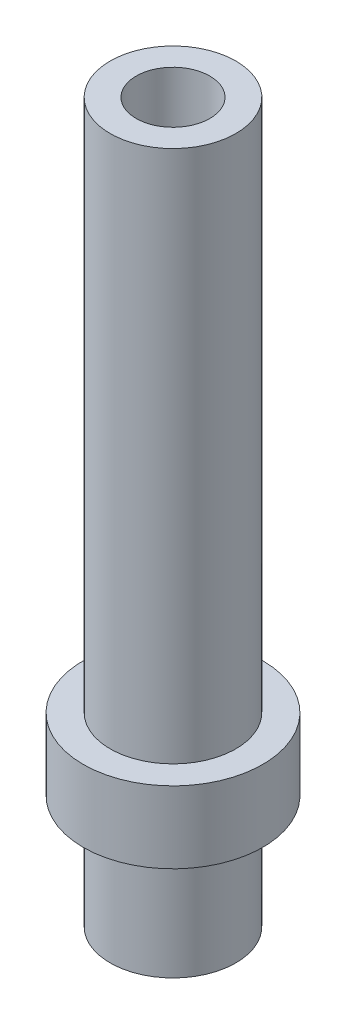
ISO-10303-21;
HEADER;
FILE_DESCRIPTION(('STEP AP214'),'2;1');
FILE_NAME('part.step','',(''),(''),'','','');
FILE_SCHEMA(('AUTOMOTIVE_DESIGN { 1 0 10303 214 1 1 1 1 }'));
ENDSEC;
DATA;
#1=APPLICATION_CONTEXT('core data for automotive mechanical design processes');
#2=APPLICATION_PROTOCOL_DEFINITION('international standard','automotive_design',2000,#1);
#3=PRODUCT_CONTEXT('',#1,'mechanical');
#4=PRODUCT('Part','Part','',(#3));
#5=PRODUCT_RELATED_PRODUCT_CATEGORY('part','',(#4));
#6=PRODUCT_DEFINITION_FORMATION('','',#4);
#7=PRODUCT_DEFINITION_CONTEXT('part definition',#1,'design');
#8=PRODUCT_DEFINITION('design','',#6,#7);
#9=PRODUCT_DEFINITION_SHAPE('','',#8);
#10=(LENGTH_UNIT() NAMED_UNIT(*) SI_UNIT(.MILLI.,.METRE.));
#11=(NAMED_UNIT(*) PLANE_ANGLE_UNIT() SI_UNIT($,.RADIAN.));
#12=(NAMED_UNIT(*) SI_UNIT($,.STERADIAN.) SOLID_ANGLE_UNIT());
#13=UNCERTAINTY_MEASURE_WITH_UNIT(LENGTH_MEASURE(1.E-05),#10,'distance_accuracy_value','');
#14=(GEOMETRIC_REPRESENTATION_CONTEXT(3) GLOBAL_UNCERTAINTY_ASSIGNED_CONTEXT((#13)) GLOBAL_UNIT_ASSIGNED_CONTEXT((#10,
#11,#12)) REPRESENTATION_CONTEXT('',''));
#15=CARTESIAN_POINT('',(0.,0.,0.));
#16=DIRECTION('',(0.,0.,1.));
#17=DIRECTION('',(1.,0.,0.));
#18=AXIS2_PLACEMENT_3D('',#15,#16,#17);
#19=CARTESIAN_POINT('',(0.,0.,-17.5));
#20=DIRECTION('',(0.,-1.,0.));
#21=DIRECTION('',(0.,0.,-1.));
#22=AXIS2_PLACEMENT_3D('',#19,#20,#21);
#23=PLANE('',#22);
#24=CARTESIAN_POINT('',(0.,0.,0.));
#25=DIRECTION('',(0.,-1.,0.));
#26=DIRECTION('',(0.,0.,-1.));
#27=AXIS2_PLACEMENT_3D('',#24,#25,#26);
#28=CIRCLE('',#27,17.5);
#29=CARTESIAN_POINT('',(0.,0.,-17.5));
#30=VERTEX_POINT('',#29);
#31=EDGE_CURVE('E59',#30,#30,#28,.T.);
#32=ORIENTED_EDGE('',*,*,#31,.T.);
#33=EDGE_LOOP('',(#32));
#34=FACE_BOUND('',#33,.T.);
#35=CARTESIAN_POINT('',(0.,0.,0.));
#36=DIRECTION('',(0.,-1.,0.));
#37=DIRECTION('',(0.,0.,-1.));
#38=AXIS2_PLACEMENT_3D('',#35,#36,#37);
#39=CIRCLE('',#38,10.25);
#40=CARTESIAN_POINT('',(0.,0.,-10.25));
#41=VERTEX_POINT('',#40);
#42=EDGE_CURVE('E10',#41,#41,#39,.T.);
#43=ORIENTED_EDGE('',*,*,#42,.F.);
#44=EDGE_LOOP('',(#43));
#45=FACE_BOUND('',#44,.T.);
#46=ADVANCED_FACE('F31',(#34,#45),#23,.T.);
#47=CARTESIAN_POINT('',(0.,0.,0.));
#48=DIRECTION('',(0.,-1.,0.));
#49=DIRECTION('',(0.,0.,-1.));
#50=AXIS2_PLACEMENT_3D('',#47,#48,#49);
#51=CYLINDRICAL_SURFACE('',#50,10.25);
#52=ORIENTED_EDGE('',*,*,#42,.T.);
#53=EDGE_LOOP('',(#52));
#54=FACE_BOUND('',#53,.T.);
#55=CARTESIAN_POINT('',(0.,200.,0.));
#56=DIRECTION('',(0.,-1.,0.));
#57=DIRECTION('',(0.,0.,-1.));
#58=AXIS2_PLACEMENT_3D('',#55,#56,#57);
#59=CIRCLE('',#58,10.25);
#60=CARTESIAN_POINT('',(0.,200.,-10.25));
#61=VERTEX_POINT('',#60);
#62=EDGE_CURVE('E37',#61,#61,#59,.T.);
#63=ORIENTED_EDGE('',*,*,#62,.F.);
#64=EDGE_LOOP('',(#63));
#65=FACE_BOUND('',#64,.T.);
#66=ADVANCED_FACE('F77',(#54,#65),#51,.F.);
#67=CARTESIAN_POINT('',(0.,200.,-10.25));
#68=DIRECTION('',(0.,1.,0.));
#69=DIRECTION('',(0.,0.,1.));
#70=AXIS2_PLACEMENT_3D('',#67,#68,#69);
#71=PLANE('',#70);
#72=ORIENTED_EDGE('',*,*,#62,.T.);
#73=EDGE_LOOP('',(#72));
#74=FACE_BOUND('',#73,.T.);
#75=CARTESIAN_POINT('',(0.,200.,0.));
#76=DIRECTION('',(0.,-1.,0.));
#77=DIRECTION('',(0.,0.,-1.));
#78=AXIS2_PLACEMENT_3D('',#75,#76,#77);
#79=CIRCLE('',#78,17.5);
#80=CARTESIAN_POINT('',(0.,200.,-17.5));
#81=VERTEX_POINT('',#80);
#82=EDGE_CURVE('E41',#81,#81,#79,.T.);
#83=ORIENTED_EDGE('',*,*,#82,.F.);
#84=EDGE_LOOP('',(#83));
#85=FACE_BOUND('',#84,.T.);
#86=ADVANCED_FACE('F81',(#74,#85),#71,.T.);
#87=CARTESIAN_POINT('',(0.,0.,0.));
#88=DIRECTION('',(0.,-1.,0.));
#89=DIRECTION('',(0.,0.,-1.));
#90=AXIS2_PLACEMENT_3D('',#87,#88,#89);
#91=CYLINDRICAL_SURFACE('',#90,17.5);
#92=ORIENTED_EDGE('',*,*,#82,.T.);
#93=EDGE_LOOP('',(#92));
#94=FACE_BOUND('',#93,.T.);
#95=CARTESIAN_POINT('',(0.,51.6233235976995,0.));
#96=DIRECTION('',(0.,-1.,0.));
#97=DIRECTION('',(0.,0.,-1.));
#98=AXIS2_PLACEMENT_3D('',#95,#96,#97);
#99=CIRCLE('',#98,17.5);
#100=CARTESIAN_POINT('',(0.,51.6233235976995,-17.5));
#101=VERTEX_POINT('',#100);
#102=EDGE_CURVE('E45',#101,#101,#99,.T.);
#103=ORIENTED_EDGE('',*,*,#102,.F.);
#104=EDGE_LOOP('',(#103));
#105=FACE_BOUND('',#104,.T.);
#106=ADVANCED_FACE('F85',(#94,#105),#91,.T.);
#107=CARTESIAN_POINT('',(0.,51.6233235976995,-17.5));
#108=DIRECTION('',(0.,1.,0.));
#109=DIRECTION('',(0.,0.,1.));
#110=AXIS2_PLACEMENT_3D('',#107,#108,#109);
#111=PLANE('',#110);
#112=ORIENTED_EDGE('',*,*,#102,.T.);
#113=EDGE_LOOP('',(#112));
#114=FACE_BOUND('',#113,.T.);
#115=CARTESIAN_POINT('',(0.,51.6233235976995,0.));
#116=DIRECTION('',(0.,-1.,0.));
#117=DIRECTION('',(0.,0.,-1.));
#118=AXIS2_PLACEMENT_3D('',#115,#116,#117);
#119=CIRCLE('',#118,25.);
#120=CARTESIAN_POINT('',(0.,51.6233235976995,-25.));
#121=VERTEX_POINT('',#120);
#122=EDGE_CURVE('E50',#121,#121,#119,.T.);
#123=ORIENTED_EDGE('',*,*,#122,.F.);
#124=EDGE_LOOP('',(#123));
#125=FACE_BOUND('',#124,.T.);
#126=ADVANCED_FACE('F91',(#114,#125),#111,.T.);
#127=CARTESIAN_POINT('',(0.,0.,0.));
#128=DIRECTION('',(0.,-1.,0.));
#129=DIRECTION('',(0.,0.,-1.));
#130=AXIS2_PLACEMENT_3D('',#127,#128,#129);
#131=CYLINDRICAL_SURFACE('',#130,25.);
#132=ORIENTED_EDGE('',*,*,#122,.T.);
#133=EDGE_LOOP('',(#132));
#134=FACE_BOUND('',#133,.T.);
#135=CARTESIAN_POINT('',(0.,31.6233235976995,0.));
#136=DIRECTION('',(0.,-1.,0.));
#137=DIRECTION('',(0.,0.,-1.));
#138=AXIS2_PLACEMENT_3D('',#135,#136,#137);
#139=CIRCLE('',#138,25.);
#140=CARTESIAN_POINT('',(0.,31.6233235976995,-25.));
#141=VERTEX_POINT('',#140);
#142=EDGE_CURVE('E53',#141,#141,#139,.T.);
#143=ORIENTED_EDGE('',*,*,#142,.F.);
#144=EDGE_LOOP('',(#143));
#145=FACE_BOUND('',#144,.T.);
#146=ADVANCED_FACE('F73',(#134,#145),#131,.T.);
#147=CARTESIAN_POINT('',(0.,31.6233235976995,-25.));
#148=DIRECTION('',(0.,-1.,0.));
#149=DIRECTION('',(0.,0.,-1.));
#150=AXIS2_PLACEMENT_3D('',#147,#148,#149);
#151=PLANE('',#150);
#152=ORIENTED_EDGE('',*,*,#142,.T.);
#153=EDGE_LOOP('',(#152));
#154=FACE_BOUND('',#153,.T.);
#155=CARTESIAN_POINT('',(0.,31.6233235976995,0.));
#156=DIRECTION('',(0.,-1.,0.));
#157=DIRECTION('',(0.,0.,-1.));
#158=AXIS2_PLACEMENT_3D('',#155,#156,#157);
#159=CIRCLE('',#158,17.5);
#160=CARTESIAN_POINT('',(0.,31.6233235976995,-17.5));
#161=VERTEX_POINT('',#160);
#162=EDGE_CURVE('E56',#161,#161,#159,.T.);
#163=ORIENTED_EDGE('',*,*,#162,.F.);
#164=EDGE_LOOP('',(#163));
#165=FACE_BOUND('',#164,.T.);
#166=ADVANCED_FACE('F67',(#154,#165),#151,.T.);
#167=CARTESIAN_POINT('',(0.,0.,0.));
#168=DIRECTION('',(0.,-1.,0.));
#169=DIRECTION('',(0.,0.,-1.));
#170=AXIS2_PLACEMENT_3D('',#167,#168,#169);
#171=CYLINDRICAL_SURFACE('',#170,17.5);
#172=ORIENTED_EDGE('',*,*,#162,.T.);
#173=EDGE_LOOP('',(#172));
#174=FACE_BOUND('',#173,.T.);
#175=ORIENTED_EDGE('',*,*,#31,.F.);
#176=EDGE_LOOP('',(#175));
#177=FACE_BOUND('',#176,.T.);
#178=ADVANCED_FACE('F65',(#174,#177),#171,.T.);
#179=CLOSED_SHELL('',(#46,#66,#86,#106,#126,#146,#166,#178));
#180=MANIFOLD_SOLID_BREP('B2',#179);
#181=ADVANCED_BREP_SHAPE_REPRESENTATION('',(#18,#180),#14);
#182=SHAPE_DEFINITION_REPRESENTATION(#9,#181);
ENDSEC;
END-ISO-10303-21;
